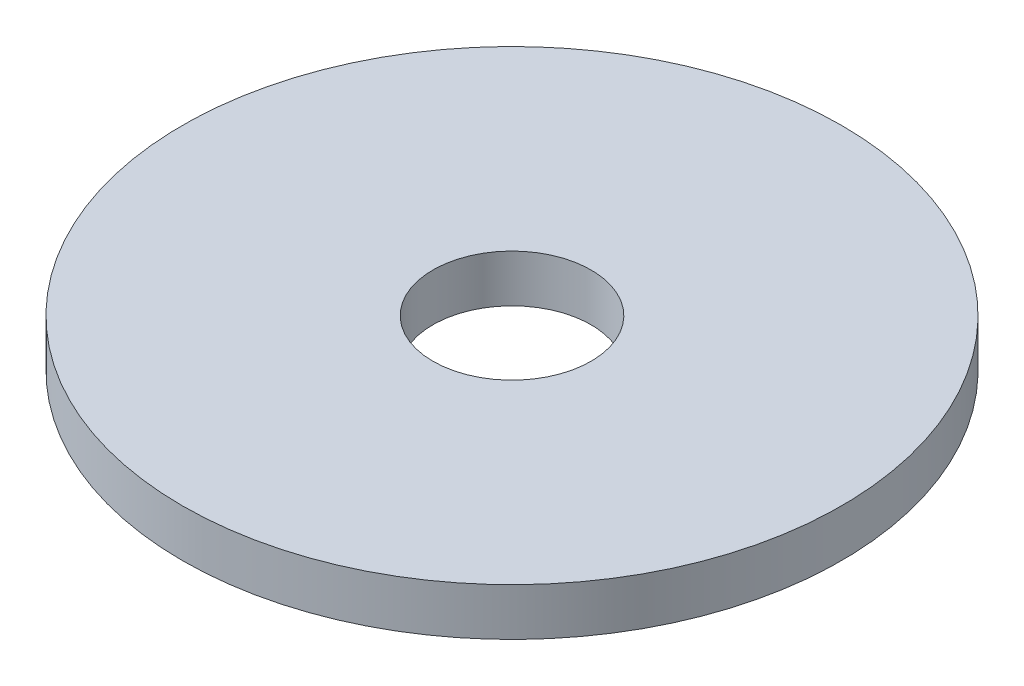
ISO-10303-21;
HEADER;
FILE_DESCRIPTION(('STEP AP214'),'2;1');
FILE_NAME('part.step','',(''),(''),'','','');
FILE_SCHEMA(('AUTOMOTIVE_DESIGN { 1 0 10303 214 1 1 1 1 }'));
ENDSEC;
DATA;
#1=APPLICATION_CONTEXT('core data for automotive mechanical design processes');
#2=APPLICATION_PROTOCOL_DEFINITION('international standard','automotive_design',2000,#1);
#3=PRODUCT_CONTEXT('',#1,'mechanical');
#4=PRODUCT('Part','Part','',(#3));
#5=PRODUCT_RELATED_PRODUCT_CATEGORY('part','',(#4));
#6=PRODUCT_DEFINITION_FORMATION('','',#4);
#7=PRODUCT_DEFINITION_CONTEXT('part definition',#1,'design');
#8=PRODUCT_DEFINITION('design','',#6,#7);
#9=PRODUCT_DEFINITION_SHAPE('','',#8);
#10=(LENGTH_UNIT() NAMED_UNIT(*) SI_UNIT(.MILLI.,.METRE.));
#11=(NAMED_UNIT(*) PLANE_ANGLE_UNIT() SI_UNIT($,.RADIAN.));
#12=(NAMED_UNIT(*) SI_UNIT($,.STERADIAN.) SOLID_ANGLE_UNIT());
#13=UNCERTAINTY_MEASURE_WITH_UNIT(LENGTH_MEASURE(1.E-05),#10,'distance_accuracy_value','');
#14=(GEOMETRIC_REPRESENTATION_CONTEXT(3) GLOBAL_UNCERTAINTY_ASSIGNED_CONTEXT((#13)) GLOBAL_UNIT_ASSIGNED_CONTEXT((#10,
#11,#12)) REPRESENTATION_CONTEXT('',''));
#15=CARTESIAN_POINT('',(0.,0.,0.));
#16=DIRECTION('',(0.,0.,1.));
#17=DIRECTION('',(1.,0.,0.));
#18=AXIS2_PLACEMENT_3D('',#15,#16,#17);
#19=CARTESIAN_POINT('',(0.,9.,0.));
#20=DIRECTION('',(0.,-1.,0.));
#21=DIRECTION('',(0.,0.,-1.));
#22=AXIS2_PLACEMENT_3D('',#19,#20,#21);
#23=CYLINDRICAL_SURFACE('',#22,62.5);
#24=CARTESIAN_POINT('',(0.,9.,0.));
#25=DIRECTION('',(0.,1.,0.));
#26=DIRECTION('',(0.,0.,1.));
#27=AXIS2_PLACEMENT_3D('',#24,#25,#26);
#28=CIRCLE('',#27,62.5);
#29=CARTESIAN_POINT('',(0.,9.,62.5));
#30=VERTEX_POINT('',#29);
#31=EDGE_CURVE('E10',#30,#30,#28,.T.);
#32=ORIENTED_EDGE('',*,*,#31,.F.);
#33=EDGE_LOOP('',(#32));
#34=FACE_BOUND('',#33,.T.);
#35=CARTESIAN_POINT('',(0.,0.,0.));
#36=DIRECTION('',(0.,1.,0.));
#37=DIRECTION('',(0.,0.,1.));
#38=AXIS2_PLACEMENT_3D('',#35,#36,#37);
#39=CIRCLE('',#38,62.5);
#40=CARTESIAN_POINT('',(0.,0.,62.5));
#41=VERTEX_POINT('',#40);
#42=EDGE_CURVE('E37',#41,#41,#39,.T.);
#43=ORIENTED_EDGE('',*,*,#42,.T.);
#44=EDGE_LOOP('',(#43));
#45=FACE_BOUND('',#44,.T.);
#46=ADVANCED_FACE('F40',(#34,#45),#23,.T.);
#47=CARTESIAN_POINT('',(0.,9.,0.));
#48=DIRECTION('',(0.,1.,0.));
#49=DIRECTION('',(0.,0.,1.));
#50=AXIS2_PLACEMENT_3D('',#47,#48,#49);
#51=PLANE('',#50);
#52=CARTESIAN_POINT('',(0.,9.,0.));
#53=DIRECTION('',(0.,1.,0.));
#54=DIRECTION('',(0.,0.,1.));
#55=AXIS2_PLACEMENT_3D('',#52,#53,#54);
#56=CIRCLE('',#55,15.);
#57=CARTESIAN_POINT('',(0.,9.,15.));
#58=VERTEX_POINT('',#57);
#59=EDGE_CURVE('E50',#58,#58,#56,.T.);
#60=ORIENTED_EDGE('',*,*,#59,.F.);
#61=EDGE_LOOP('',(#60));
#62=FACE_BOUND('',#61,.T.);
#63=ORIENTED_EDGE('',*,*,#31,.T.);
#64=EDGE_LOOP('',(#63));
#65=FACE_BOUND('',#64,.T.);
#66=ADVANCED_FACE('F59',(#62,#65),#51,.T.);
#67=CARTESIAN_POINT('',(0.,0.,0.));
#68=DIRECTION('',(0.,1.,0.));
#69=DIRECTION('',(0.,0.,1.));
#70=AXIS2_PLACEMENT_3D('',#67,#68,#69);
#71=PLANE('',#70);
#72=CARTESIAN_POINT('',(0.,0.,0.));
#73=DIRECTION('',(0.,1.,0.));
#74=DIRECTION('',(0.,0.,1.));
#75=AXIS2_PLACEMENT_3D('',#72,#73,#74);
#76=CIRCLE('',#75,15.);
#77=CARTESIAN_POINT('',(0.,0.,15.));
#78=VERTEX_POINT('',#77);
#79=EDGE_CURVE('E47',#78,#78,#76,.T.);
#80=ORIENTED_EDGE('',*,*,#79,.T.);
#81=EDGE_LOOP('',(#80));
#82=FACE_BOUND('',#81,.T.);
#83=ORIENTED_EDGE('',*,*,#42,.F.);
#84=EDGE_LOOP('',(#83));
#85=FACE_BOUND('',#84,.T.);
#86=ADVANCED_FACE('F58',(#82,#85),#71,.F.);
#87=CARTESIAN_POINT('',(0.,9.,0.));
#88=DIRECTION('',(0.,-1.,0.));
#89=DIRECTION('',(0.,0.,-1.));
#90=AXIS2_PLACEMENT_3D('',#87,#88,#89);
#91=CYLINDRICAL_SURFACE('',#90,15.);
#92=ORIENTED_EDGE('',*,*,#59,.T.);
#93=EDGE_LOOP('',(#92));
#94=FACE_BOUND('',#93,.T.);
#95=ORIENTED_EDGE('',*,*,#79,.F.);
#96=EDGE_LOOP('',(#95));
#97=FACE_BOUND('',#96,.T.);
#98=ADVANCED_FACE('F54',(#94,#97),#91,.F.);
#99=CLOSED_SHELL('',(#46,#66,#86,#98));
#100=MANIFOLD_SOLID_BREP('B2',#99);
#101=ADVANCED_BREP_SHAPE_REPRESENTATION('',(#18,#100),#14);
#102=SHAPE_DEFINITION_REPRESENTATION(#9,#101);
ENDSEC;
END-ISO-10303-21;
